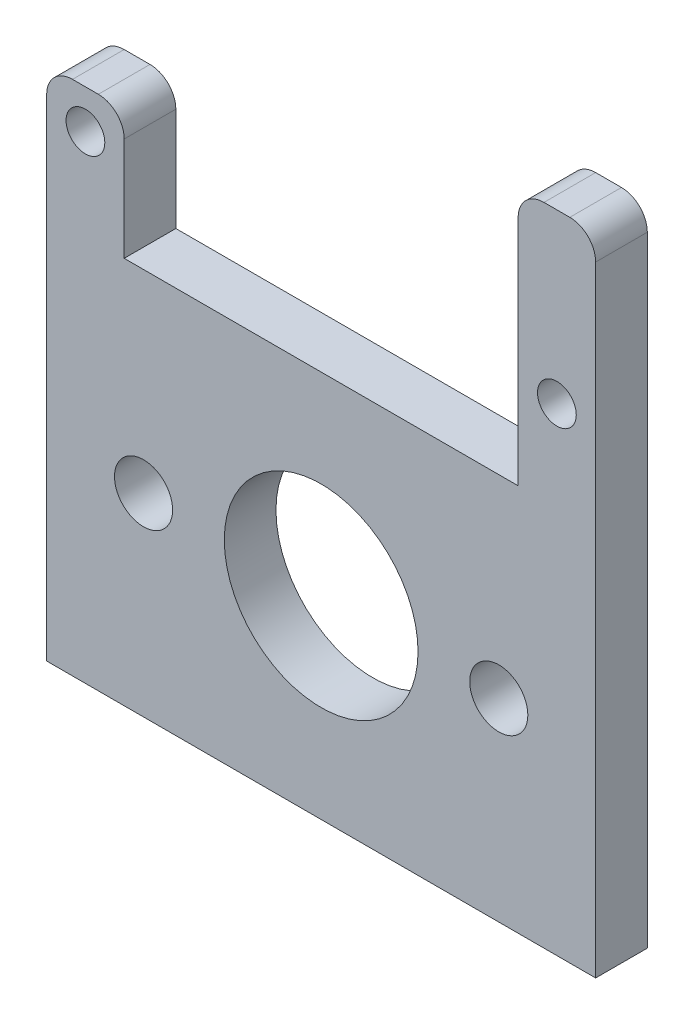
ISO-10303-21;
HEADER;
FILE_DESCRIPTION(('STEP AP214'),'2;1');
FILE_NAME('part.step','',(''),(''),'','','');
FILE_SCHEMA(('AUTOMOTIVE_DESIGN { 1 0 10303 214 1 1 1 1 }'));
ENDSEC;
DATA;
#1=APPLICATION_CONTEXT('core data for automotive mechanical design processes');
#2=APPLICATION_PROTOCOL_DEFINITION('international standard','automotive_design',2000,#1);
#3=PRODUCT_CONTEXT('',#1,'mechanical');
#4=PRODUCT('Part','Part','',(#3));
#5=PRODUCT_RELATED_PRODUCT_CATEGORY('part','',(#4));
#6=PRODUCT_DEFINITION_FORMATION('','',#4);
#7=PRODUCT_DEFINITION_CONTEXT('part definition',#1,'design');
#8=PRODUCT_DEFINITION('design','',#6,#7);
#9=PRODUCT_DEFINITION_SHAPE('','',#8);
#10=(LENGTH_UNIT() NAMED_UNIT(*) SI_UNIT(.MILLI.,.METRE.));
#11=(NAMED_UNIT(*) PLANE_ANGLE_UNIT() SI_UNIT($,.RADIAN.));
#12=(NAMED_UNIT(*) SI_UNIT($,.STERADIAN.) SOLID_ANGLE_UNIT());
#13=UNCERTAINTY_MEASURE_WITH_UNIT(LENGTH_MEASURE(1.E-05),#10,'distance_accuracy_value','');
#14=(GEOMETRIC_REPRESENTATION_CONTEXT(3) GLOBAL_UNCERTAINTY_ASSIGNED_CONTEXT((#13)) GLOBAL_UNIT_ASSIGNED_CONTEXT((#10,
#11,#12)) REPRESENTATION_CONTEXT('',''));
#15=CARTESIAN_POINT('',(0.,0.,0.));
#16=DIRECTION('',(0.,0.,1.));
#17=DIRECTION('',(1.,0.,0.));
#18=AXIS2_PLACEMENT_3D('',#15,#16,#17);
#19=CARTESIAN_POINT('',(0.,0.,4.));
#20=DIRECTION('',(0.,0.,-1.));
#21=DIRECTION('',(-1.,0.,0.));
#22=AXIS2_PLACEMENT_3D('',#19,#20,#21);
#23=PLANE('',#22);
#24=DIRECTION('',(0.,1.,0.));
#25=VECTOR('',#24,1.);
#26=CARTESIAN_POINT('',(24.4921299184247,30.6088438088065,4.));
#27=LINE('',#26,#25);
#28=CARTESIAN_POINT('',(24.4921299184247,-19.3911561911935,4.));
#29=VERTEX_POINT('',#28);
#30=CARTESIAN_POINT('',(24.4921299184247,28.6088438088065,4.));
#31=VERTEX_POINT('',#30);
#32=EDGE_CURVE('E151',#29,#31,#27,.T.);
#33=ORIENTED_EDGE('',*,*,#32,.T.);
#34=CARTESIAN_POINT('',(22.4921299184247,28.6088438088065,4.));
#35=DIRECTION('',(0.,0.,-1.));
#36=DIRECTION('',(-1.,0.,0.));
#37=AXIS2_PLACEMENT_3D('',#34,#35,#36);
#38=CIRCLE('',#37,2.);
#39=CARTESIAN_POINT('',(22.4921299184247,30.6088438088065,4.));
#40=VERTEX_POINT('',#39);
#41=EDGE_CURVE('E208',#31,#40,#38,.F.);
#42=ORIENTED_EDGE('',*,*,#41,.T.);
#43=DIRECTION('',(-1.,0.,0.));
#44=VECTOR('',#43,1.);
#45=CARTESIAN_POINT('',(18.4921299184247,30.6088438088065,4.));
#46=LINE('',#45,#44);
#47=CARTESIAN_POINT('',(20.4921299184247,30.6088438088065,4.));
#48=VERTEX_POINT('',#47);
#49=EDGE_CURVE('E153',#40,#48,#46,.T.);
#50=ORIENTED_EDGE('',*,*,#49,.T.);
#51=CARTESIAN_POINT('',(20.4921299184247,28.6088438088065,4.));
#52=DIRECTION('',(0.,0.,-1.));
#53=DIRECTION('',(-1.,0.,0.));
#54=AXIS2_PLACEMENT_3D('',#51,#52,#53);
#55=CIRCLE('',#54,2.);
#56=CARTESIAN_POINT('',(18.4921299184247,28.6088438088065,4.));
#57=VERTEX_POINT('',#56);
#58=EDGE_CURVE('E57',#48,#57,#55,.F.);
#59=ORIENTED_EDGE('',*,*,#58,.T.);
#60=DIRECTION('',(0.,-1.,0.));
#61=VECTOR('',#60,1.);
#62=CARTESIAN_POINT('',(18.4921299184247,10.6088438088065,4.));
#63=LINE('',#62,#61);
#64=CARTESIAN_POINT('',(18.4921299184247,10.6088438088065,4.));
#65=VERTEX_POINT('',#64);
#66=EDGE_CURVE('E158',#57,#65,#63,.T.);
#67=ORIENTED_EDGE('',*,*,#66,.T.);
#68=DIRECTION('',(-1.,0.,0.));
#69=VECTOR('',#68,1.);
#70=CARTESIAN_POINT('',(-12.0078700815753,10.6088438088065,4.));
#71=LINE('',#70,#69);
#72=CARTESIAN_POINT('',(-12.0078700815753,10.6088438088065,4.));
#73=VERTEX_POINT('',#72);
#74=EDGE_CURVE('E160',#65,#73,#71,.T.);
#75=ORIENTED_EDGE('',*,*,#74,.T.);
#76=DIRECTION('',(0.,1.,0.));
#77=VECTOR('',#76,1.);
#78=CARTESIAN_POINT('',(-12.0078700815753,20.6088438088065,4.));
#79=LINE('',#78,#77);
#80=CARTESIAN_POINT('',(-12.0078700815753,18.6088438088065,4.));
#81=VERTEX_POINT('',#80);
#82=EDGE_CURVE('E162',#73,#81,#79,.T.);
#83=ORIENTED_EDGE('',*,*,#82,.T.);
#84=CARTESIAN_POINT('',(-14.0078700815753,18.6088438088065,4.));
#85=DIRECTION('',(0.,0.,-1.));
#86=DIRECTION('',(-1.,0.,0.));
#87=AXIS2_PLACEMENT_3D('',#84,#85,#86);
#88=CIRCLE('',#87,2.);
#89=CARTESIAN_POINT('',(-14.0078700815753,20.6088438088065,4.));
#90=VERTEX_POINT('',#89);
#91=EDGE_CURVE('E205',#81,#90,#88,.F.);
#92=ORIENTED_EDGE('',*,*,#91,.T.);
#93=DIRECTION('',(-1.,0.,0.));
#94=VECTOR('',#93,1.);
#95=CARTESIAN_POINT('',(-18.0078700815753,20.6088438088065,4.));
#96=LINE('',#95,#94);
#97=CARTESIAN_POINT('',(-16.0078700815753,20.6088438088065,4.));
#98=VERTEX_POINT('',#97);
#99=EDGE_CURVE('E136',#90,#98,#96,.T.);
#100=ORIENTED_EDGE('',*,*,#99,.T.);
#101=CARTESIAN_POINT('',(-16.0078700815753,18.6088438088065,4.));
#102=DIRECTION('',(0.,0.,-1.));
#103=DIRECTION('',(-1.,0.,0.));
#104=AXIS2_PLACEMENT_3D('',#101,#102,#103);
#105=CIRCLE('',#104,2.);
#106=CARTESIAN_POINT('',(-18.0078700815753,18.6088438088065,4.));
#107=VERTEX_POINT('',#106);
#108=EDGE_CURVE('E133',#98,#107,#105,.F.);
#109=ORIENTED_EDGE('',*,*,#108,.T.);
#110=DIRECTION('',(0.,-1.,0.));
#111=VECTOR('',#110,1.);
#112=CARTESIAN_POINT('',(-18.0078700815753,20.6088438088065,4.));
#113=LINE('',#112,#111);
#114=CARTESIAN_POINT('',(-18.0078700815753,-19.3911561911935,4.));
#115=VERTEX_POINT('',#114);
#116=EDGE_CURVE('E124',#107,#115,#113,.T.);
#117=ORIENTED_EDGE('',*,*,#116,.T.);
#118=DIRECTION('',(1.,0.,0.));
#119=VECTOR('',#118,1.);
#120=CARTESIAN_POINT('',(24.4921299184247,-19.3911561911935,4.));
#121=LINE('',#120,#119);
#122=EDGE_CURVE('E129',#115,#29,#121,.T.);
#123=ORIENTED_EDGE('',*,*,#122,.T.);
#124=EDGE_LOOP('',(#33,#42,#50,#59,#67,#75,#83,#92,#100,#109,#117,#123));
#125=FACE_BOUND('',#124,.T.);
#126=CARTESIAN_POINT('',(-15.0078700815753,17.6088438088065,4.));
#127=DIRECTION('',(0.,0.,1.));
#128=DIRECTION('',(1.,0.,0.));
#129=AXIS2_PLACEMENT_3D('',#126,#127,#128);
#130=CIRCLE('',#129,1.5);
#131=CARTESIAN_POINT('',(-13.5078700815753,17.6088438088065,4.));
#132=VERTEX_POINT('',#131);
#133=EDGE_CURVE('E168',#132,#132,#130,.T.);
#134=ORIENTED_EDGE('',*,*,#133,.F.);
#135=EDGE_LOOP('',(#134));
#136=FACE_BOUND('',#135,.T.);
#137=CARTESIAN_POINT('',(21.4921299184247,17.6088438088065,4.));
#138=DIRECTION('',(0.,0.,1.));
#139=DIRECTION('',(1.,0.,0.));
#140=AXIS2_PLACEMENT_3D('',#137,#138,#139);
#141=CIRCLE('',#140,1.5);
#142=CARTESIAN_POINT('',(22.9921299184247,17.6088438088065,4.));
#143=VERTEX_POINT('',#142);
#144=EDGE_CURVE('E235',#143,#143,#141,.T.);
#145=ORIENTED_EDGE('',*,*,#144,.F.);
#146=EDGE_LOOP('',(#145));
#147=FACE_BOUND('',#146,.T.);
#148=CARTESIAN_POINT('',(-10.5078700815753,-4.39115619119349,4.));
#149=DIRECTION('',(0.,0.,1.));
#150=DIRECTION('',(1.,0.,0.));
#151=AXIS2_PLACEMENT_3D('',#148,#149,#150);
#152=CIRCLE('',#151,2.25);
#153=CARTESIAN_POINT('',(-8.25787008157528,-4.39115619119349,4.));
#154=VERTEX_POINT('',#153);
#155=EDGE_CURVE('E241',#154,#154,#152,.T.);
#156=ORIENTED_EDGE('',*,*,#155,.F.);
#157=EDGE_LOOP('',(#156));
#158=FACE_BOUND('',#157,.T.);
#159=CARTESIAN_POINT('',(16.9921299184247,-4.39115619119348,4.));
#160=DIRECTION('',(0.,0.,1.));
#161=DIRECTION('',(1.,0.,0.));
#162=AXIS2_PLACEMENT_3D('',#159,#160,#161);
#163=CIRCLE('',#162,2.25);
#164=CARTESIAN_POINT('',(19.2421299184247,-4.39115619119348,4.));
#165=VERTEX_POINT('',#164);
#166=EDGE_CURVE('E247',#165,#165,#163,.T.);
#167=ORIENTED_EDGE('',*,*,#166,.F.);
#168=EDGE_LOOP('',(#167));
#169=FACE_BOUND('',#168,.T.);
#170=CARTESIAN_POINT('',(3.24212991842472,-4.39115619119348,4.));
#171=DIRECTION('',(0.,0.,1.));
#172=DIRECTION('',(1.,0.,0.));
#173=AXIS2_PLACEMENT_3D('',#170,#171,#172);
#174=CIRCLE('',#173,7.5);
#175=CARTESIAN_POINT('',(10.7421299184247,-4.39115619119348,4.));
#176=VERTEX_POINT('',#175);
#177=EDGE_CURVE('E253',#176,#176,#174,.T.);
#178=ORIENTED_EDGE('',*,*,#177,.F.);
#179=EDGE_LOOP('',(#178));
#180=FACE_BOUND('',#179,.T.);
#181=ADVANCED_FACE('F35',(#125,#136,#147,#158,#169,#180),#23,.F.);
#182=CARTESIAN_POINT('',(0.,0.,0.));
#183=DIRECTION('',(0.,0.,-1.));
#184=DIRECTION('',(-1.,0.,0.));
#185=AXIS2_PLACEMENT_3D('',#182,#183,#184);
#186=PLANE('',#185);
#187=CARTESIAN_POINT('',(16.9921299184247,-4.39115619119348,0.));
#188=DIRECTION('',(0.,0.,1.));
#189=DIRECTION('',(1.,0.,0.));
#190=AXIS2_PLACEMENT_3D('',#187,#188,#189);
#191=CIRCLE('',#190,2.25);
#192=CARTESIAN_POINT('',(19.2421299184247,-4.39115619119348,0.));
#193=VERTEX_POINT('',#192);
#194=EDGE_CURVE('E250',#193,#193,#191,.T.);
#195=ORIENTED_EDGE('',*,*,#194,.T.);
#196=EDGE_LOOP('',(#195));
#197=FACE_BOUND('',#196,.T.);
#198=CARTESIAN_POINT('',(21.4921299184247,17.6088438088065,0.));
#199=DIRECTION('',(0.,0.,1.));
#200=DIRECTION('',(1.,0.,0.));
#201=AXIS2_PLACEMENT_3D('',#198,#199,#200);
#202=CIRCLE('',#201,1.5);
#203=CARTESIAN_POINT('',(22.9921299184247,17.6088438088065,0.));
#204=VERTEX_POINT('',#203);
#205=EDGE_CURVE('E238',#204,#204,#202,.T.);
#206=ORIENTED_EDGE('',*,*,#205,.T.);
#207=EDGE_LOOP('',(#206));
#208=FACE_BOUND('',#207,.T.);
#209=DIRECTION('',(-1.,0.,0.));
#210=VECTOR('',#209,1.);
#211=CARTESIAN_POINT('',(18.4921299184247,30.6088438088065,0.));
#212=LINE('',#211,#210);
#213=CARTESIAN_POINT('',(22.4921299184247,30.6088438088065,0.));
#214=VERTEX_POINT('',#213);
#215=CARTESIAN_POINT('',(20.4921299184247,30.6088438088065,0.));
#216=VERTEX_POINT('',#215);
#217=EDGE_CURVE('E175',#214,#216,#212,.T.);
#218=ORIENTED_EDGE('',*,*,#217,.F.);
#219=CARTESIAN_POINT('',(22.4921299184247,28.6088438088065,0.));
#220=DIRECTION('',(0.,0.,-1.));
#221=DIRECTION('',(-1.,0.,0.));
#222=AXIS2_PLACEMENT_3D('',#219,#220,#221);
#223=CIRCLE('',#222,2.);
#224=CARTESIAN_POINT('',(24.4921299184247,28.6088438088065,0.));
#225=VERTEX_POINT('',#224);
#226=EDGE_CURVE('E200',#214,#225,#223,.T.);
#227=ORIENTED_EDGE('',*,*,#226,.T.);
#228=DIRECTION('',(0.,1.,0.));
#229=VECTOR('',#228,1.);
#230=CARTESIAN_POINT('',(24.4921299184247,30.6088438088065,0.));
#231=LINE('',#230,#229);
#232=CARTESIAN_POINT('',(24.4921299184247,-19.3911561911935,0.));
#233=VERTEX_POINT('',#232);
#234=EDGE_CURVE('E172',#233,#225,#231,.T.);
#235=ORIENTED_EDGE('',*,*,#234,.F.);
#236=DIRECTION('',(1.,0.,0.));
#237=VECTOR('',#236,1.);
#238=CARTESIAN_POINT('',(24.4921299184247,-19.3911561911935,0.));
#239=LINE('',#238,#237);
#240=CARTESIAN_POINT('',(-18.0078700815753,-19.3911561911935,0.));
#241=VERTEX_POINT('',#240);
#242=EDGE_CURVE('E170',#241,#233,#239,.T.);
#243=ORIENTED_EDGE('',*,*,#242,.F.);
#244=DIRECTION('',(0.,-1.,0.));
#245=VECTOR('',#244,1.);
#246=CARTESIAN_POINT('',(-18.0078700815753,-19.3911561911935,0.));
#247=LINE('',#246,#245);
#248=CARTESIAN_POINT('',(-18.0078700815753,18.6088438088065,0.));
#249=VERTEX_POINT('',#248);
#250=EDGE_CURVE('E142',#249,#241,#247,.T.);
#251=ORIENTED_EDGE('',*,*,#250,.F.);
#252=CARTESIAN_POINT('',(-16.0078700815753,18.6088438088065,0.));
#253=DIRECTION('',(0.,0.,-1.));
#254=DIRECTION('',(-1.,0.,0.));
#255=AXIS2_PLACEMENT_3D('',#252,#253,#254);
#256=CIRCLE('',#255,2.);
#257=CARTESIAN_POINT('',(-16.0078700815753,20.6088438088065,0.));
#258=VERTEX_POINT('',#257);
#259=EDGE_CURVE('E194',#249,#258,#256,.T.);
#260=ORIENTED_EDGE('',*,*,#259,.T.);
#261=DIRECTION('',(-1.,0.,0.));
#262=VECTOR('',#261,1.);
#263=CARTESIAN_POINT('',(-18.0078700815753,20.6088438088065,0.));
#264=LINE('',#263,#262);
#265=CARTESIAN_POINT('',(-14.0078700815753,20.6088438088065,0.));
#266=VERTEX_POINT('',#265);
#267=EDGE_CURVE('E165',#266,#258,#264,.T.);
#268=ORIENTED_EDGE('',*,*,#267,.F.);
#269=CARTESIAN_POINT('',(-14.0078700815753,18.6088438088065,0.));
#270=DIRECTION('',(0.,0.,-1.));
#271=DIRECTION('',(-1.,0.,0.));
#272=AXIS2_PLACEMENT_3D('',#269,#270,#271);
#273=CIRCLE('',#272,2.);
#274=CARTESIAN_POINT('',(-12.0078700815753,18.6088438088065,0.));
#275=VERTEX_POINT('',#274);
#276=EDGE_CURVE('E196',#266,#275,#273,.T.);
#277=ORIENTED_EDGE('',*,*,#276,.T.);
#278=DIRECTION('',(0.,1.,0.));
#279=VECTOR('',#278,1.);
#280=CARTESIAN_POINT('',(-12.0078700815753,20.6088438088065,0.));
#281=LINE('',#280,#279);
#282=CARTESIAN_POINT('',(-12.0078700815753,10.6088438088065,0.));
#283=VERTEX_POINT('',#282);
#284=EDGE_CURVE('E182',#283,#275,#281,.T.);
#285=ORIENTED_EDGE('',*,*,#284,.F.);
#286=DIRECTION('',(-1.,0.,0.));
#287=VECTOR('',#286,1.);
#288=CARTESIAN_POINT('',(-12.0078700815753,10.6088438088065,0.));
#289=LINE('',#288,#287);
#290=CARTESIAN_POINT('',(18.4921299184247,10.6088438088065,0.));
#291=VERTEX_POINT('',#290);
#292=EDGE_CURVE('E180',#291,#283,#289,.T.);
#293=ORIENTED_EDGE('',*,*,#292,.F.);
#294=DIRECTION('',(0.,-1.,0.));
#295=VECTOR('',#294,1.);
#296=CARTESIAN_POINT('',(18.4921299184247,10.6088438088065,0.));
#297=LINE('',#296,#295);
#298=CARTESIAN_POINT('',(18.4921299184247,28.6088438088065,0.));
#299=VERTEX_POINT('',#298);
#300=EDGE_CURVE('E178',#299,#291,#297,.T.);
#301=ORIENTED_EDGE('',*,*,#300,.F.);
#302=CARTESIAN_POINT('',(20.4921299184247,28.6088438088065,0.));
#303=DIRECTION('',(0.,0.,-1.));
#304=DIRECTION('',(-1.,0.,0.));
#305=AXIS2_PLACEMENT_3D('',#302,#303,#304);
#306=CIRCLE('',#305,2.);
#307=EDGE_CURVE('E198',#299,#216,#306,.T.);
#308=ORIENTED_EDGE('',*,*,#307,.T.);
#309=EDGE_LOOP('',(#218,#227,#235,#243,#251,#260,#268,#277,#285,#293,#301,#308));
#310=FACE_BOUND('',#309,.T.);
#311=CARTESIAN_POINT('',(-15.0078700815753,17.6088438088065,0.));
#312=DIRECTION('',(0.,0.,1.));
#313=DIRECTION('',(1.,0.,0.));
#314=AXIS2_PLACEMENT_3D('',#311,#312,#313);
#315=CIRCLE('',#314,1.5);
#316=CARTESIAN_POINT('',(-13.5078700815753,17.6088438088065,0.));
#317=VERTEX_POINT('',#316);
#318=EDGE_CURVE('E232',#317,#317,#315,.T.);
#319=ORIENTED_EDGE('',*,*,#318,.T.);
#320=EDGE_LOOP('',(#319));
#321=FACE_BOUND('',#320,.T.);
#322=CARTESIAN_POINT('',(-10.5078700815753,-4.39115619119349,0.));
#323=DIRECTION('',(0.,0.,1.));
#324=DIRECTION('',(1.,0.,0.));
#325=AXIS2_PLACEMENT_3D('',#322,#323,#324);
#326=CIRCLE('',#325,2.25);
#327=CARTESIAN_POINT('',(-8.25787008157528,-4.39115619119349,0.));
#328=VERTEX_POINT('',#327);
#329=EDGE_CURVE('E244',#328,#328,#326,.T.);
#330=ORIENTED_EDGE('',*,*,#329,.T.);
#331=EDGE_LOOP('',(#330));
#332=FACE_BOUND('',#331,.T.);
#333=CARTESIAN_POINT('',(3.24212991842472,-4.39115619119348,0.));
#334=DIRECTION('',(0.,0.,1.));
#335=DIRECTION('',(1.,0.,0.));
#336=AXIS2_PLACEMENT_3D('',#333,#334,#335);
#337=CIRCLE('',#336,7.5);
#338=CARTESIAN_POINT('',(10.7421299184247,-4.39115619119348,0.));
#339=VERTEX_POINT('',#338);
#340=EDGE_CURVE('E256',#339,#339,#337,.T.);
#341=ORIENTED_EDGE('',*,*,#340,.T.);
#342=EDGE_LOOP('',(#341));
#343=FACE_BOUND('',#342,.T.);
#344=ADVANCED_FACE('F227',(#197,#208,#310,#321,#332,#343),#186,.T.);
#345=CARTESIAN_POINT('',(-18.0078700815753,20.6088438088065,4.));
#346=DIRECTION('',(0.,-1.,0.));
#347=DIRECTION('',(0.,0.,-1.));
#348=AXIS2_PLACEMENT_3D('',#345,#346,#347);
#349=PLANE('',#348);
#350=ORIENTED_EDGE('',*,*,#99,.F.);
#351=DIRECTION('',(0.,0.,-1.));
#352=VECTOR('',#351,1.);
#353=CARTESIAN_POINT('',(-14.0078700815753,20.6088438088065,4.));
#354=LINE('',#353,#352);
#355=EDGE_CURVE('E215',#90,#266,#354,.T.);
#356=ORIENTED_EDGE('',*,*,#355,.T.);
#357=ORIENTED_EDGE('',*,*,#267,.T.);
#358=DIRECTION('',(0.,0.,-1.));
#359=VECTOR('',#358,1.);
#360=CARTESIAN_POINT('',(-16.0078700815753,20.6088438088065,4.));
#361=LINE('',#360,#359);
#362=EDGE_CURVE('E213',#258,#98,#361,.F.);
#363=ORIENTED_EDGE('',*,*,#362,.T.);
#364=EDGE_LOOP('',(#350,#356,#357,#363));
#365=FACE_BOUND('',#364,.T.);
#366=ADVANCED_FACE('F221',(#365),#349,.F.);
#367=CARTESIAN_POINT('',(-18.0078700815753,-19.3911561911935,4.));
#368=DIRECTION('',(1.,0.,0.));
#369=DIRECTION('',(0.,0.,-1.));
#370=AXIS2_PLACEMENT_3D('',#367,#368,#369);
#371=PLANE('',#370);
#372=ORIENTED_EDGE('',*,*,#116,.F.);
#373=DIRECTION('',(0.,0.,-1.));
#374=VECTOR('',#373,1.);
#375=CARTESIAN_POINT('',(-18.0078700815753,18.6088438088065,4.));
#376=LINE('',#375,#374);
#377=EDGE_CURVE('E11',#107,#249,#376,.T.);
#378=ORIENTED_EDGE('',*,*,#377,.T.);
#379=ORIENTED_EDGE('',*,*,#250,.T.);
#380=DIRECTION('',(0.,0.,-1.));
#381=VECTOR('',#380,1.);
#382=CARTESIAN_POINT('',(-18.0078700815753,-19.3911561911935,4.));
#383=LINE('',#382,#381);
#384=EDGE_CURVE('E139',#115,#241,#383,.T.);
#385=ORIENTED_EDGE('',*,*,#384,.F.);
#386=EDGE_LOOP('',(#372,#378,#379,#385));
#387=FACE_BOUND('',#386,.T.);
#388=ADVANCED_FACE('F140',(#387),#371,.F.);
#389=CARTESIAN_POINT('',(24.4921299184247,-19.3911561911935,4.));
#390=DIRECTION('',(0.,1.,0.));
#391=DIRECTION('',(-1.,0.,0.));
#392=AXIS2_PLACEMENT_3D('',#389,#390,#391);
#393=PLANE('',#392);
#394=ORIENTED_EDGE('',*,*,#242,.T.);
#395=DIRECTION('',(0.,0.,-1.));
#396=VECTOR('',#395,1.);
#397=CARTESIAN_POINT('',(24.4921299184247,-19.3911561911935,4.));
#398=LINE('',#397,#396);
#399=EDGE_CURVE('E146',#29,#233,#398,.T.);
#400=ORIENTED_EDGE('',*,*,#399,.F.);
#401=ORIENTED_EDGE('',*,*,#122,.F.);
#402=ORIENTED_EDGE('',*,*,#384,.T.);
#403=EDGE_LOOP('',(#394,#400,#401,#402));
#404=FACE_BOUND('',#403,.T.);
#405=ADVANCED_FACE('F148',(#404),#393,.F.);
#406=CARTESIAN_POINT('',(24.4921299184247,30.6088438088065,4.));
#407=DIRECTION('',(-1.,0.,0.));
#408=DIRECTION('',(0.,-1.,0.));
#409=AXIS2_PLACEMENT_3D('',#406,#407,#408);
#410=PLANE('',#409);
#411=ORIENTED_EDGE('',*,*,#234,.T.);
#412=DIRECTION('',(0.,0.,-1.));
#413=VECTOR('',#412,1.);
#414=CARTESIAN_POINT('',(24.4921299184247,28.6088438088065,4.));
#415=LINE('',#414,#413);
#416=EDGE_CURVE('E202',#225,#31,#415,.F.);
#417=ORIENTED_EDGE('',*,*,#416,.T.);
#418=ORIENTED_EDGE('',*,*,#32,.F.);
#419=ORIENTED_EDGE('',*,*,#399,.T.);
#420=EDGE_LOOP('',(#411,#417,#418,#419));
#421=FACE_BOUND('',#420,.T.);
#422=ADVANCED_FACE('F290',(#421),#410,.F.);
#423=CARTESIAN_POINT('',(18.4921299184247,30.6088438088065,4.));
#424=DIRECTION('',(0.,-1.,0.));
#425=DIRECTION('',(0.,0.,-1.));
#426=AXIS2_PLACEMENT_3D('',#423,#424,#425);
#427=PLANE('',#426);
#428=ORIENTED_EDGE('',*,*,#49,.F.);
#429=DIRECTION('',(0.,0.,-1.));
#430=VECTOR('',#429,1.);
#431=CARTESIAN_POINT('',(22.4921299184247,30.6088438088065,4.));
#432=LINE('',#431,#430);
#433=EDGE_CURVE('E191',#40,#214,#432,.T.);
#434=ORIENTED_EDGE('',*,*,#433,.T.);
#435=ORIENTED_EDGE('',*,*,#217,.T.);
#436=DIRECTION('',(0.,0.,-1.));
#437=VECTOR('',#436,1.);
#438=CARTESIAN_POINT('',(20.4921299184247,30.6088438088065,4.));
#439=LINE('',#438,#437);
#440=EDGE_CURVE('E145',#216,#48,#439,.F.);
#441=ORIENTED_EDGE('',*,*,#440,.T.);
#442=EDGE_LOOP('',(#428,#434,#435,#441));
#443=FACE_BOUND('',#442,.T.);
#444=ADVANCED_FACE('F286',(#443),#427,.F.);
#445=CARTESIAN_POINT('',(18.4921299184247,10.6088438088065,4.));
#446=DIRECTION('',(1.,0.,0.));
#447=DIRECTION('',(0.,0.,-1.));
#448=AXIS2_PLACEMENT_3D('',#445,#446,#447);
#449=PLANE('',#448);
#450=ORIENTED_EDGE('',*,*,#66,.F.);
#451=DIRECTION('',(0.,0.,-1.));
#452=VECTOR('',#451,1.);
#453=CARTESIAN_POINT('',(18.4921299184247,28.6088438088065,4.));
#454=LINE('',#453,#452);
#455=EDGE_CURVE('E210',#57,#299,#454,.T.);
#456=ORIENTED_EDGE('',*,*,#455,.T.);
#457=ORIENTED_EDGE('',*,*,#300,.T.);
#458=DIRECTION('',(0.,0.,-1.));
#459=VECTOR('',#458,1.);
#460=CARTESIAN_POINT('',(18.4921299184247,10.6088438088065,4.));
#461=LINE('',#460,#459);
#462=EDGE_CURVE('E186',#65,#291,#461,.T.);
#463=ORIENTED_EDGE('',*,*,#462,.F.);
#464=EDGE_LOOP('',(#450,#456,#457,#463));
#465=FACE_BOUND('',#464,.T.);
#466=ADVANCED_FACE('F282',(#465),#449,.F.);
#467=CARTESIAN_POINT('',(-12.0078700815753,10.6088438088065,4.));
#468=DIRECTION('',(0.,-1.,0.));
#469=DIRECTION('',(1.,0.,0.));
#470=AXIS2_PLACEMENT_3D('',#467,#468,#469);
#471=PLANE('',#470);
#472=ORIENTED_EDGE('',*,*,#292,.T.);
#473=DIRECTION('',(0.,0.,-1.));
#474=VECTOR('',#473,1.);
#475=CARTESIAN_POINT('',(-12.0078700815753,10.6088438088065,4.));
#476=LINE('',#475,#474);
#477=EDGE_CURVE('E164',#73,#283,#476,.T.);
#478=ORIENTED_EDGE('',*,*,#477,.F.);
#479=ORIENTED_EDGE('',*,*,#74,.F.);
#480=ORIENTED_EDGE('',*,*,#462,.T.);
#481=EDGE_LOOP('',(#472,#478,#479,#480));
#482=FACE_BOUND('',#481,.T.);
#483=ADVANCED_FACE('F279',(#482),#471,.F.);
#484=CARTESIAN_POINT('',(-12.0078700815753,20.6088438088065,4.));
#485=DIRECTION('',(-1.,0.,0.));
#486=DIRECTION('',(0.,0.,1.));
#487=AXIS2_PLACEMENT_3D('',#484,#485,#486);
#488=PLANE('',#487);
#489=ORIENTED_EDGE('',*,*,#284,.T.);
#490=DIRECTION('',(0.,0.,-1.));
#491=VECTOR('',#490,1.);
#492=CARTESIAN_POINT('',(-12.0078700815753,18.6088438088065,4.));
#493=LINE('',#492,#491);
#494=EDGE_CURVE('E43',#275,#81,#493,.F.);
#495=ORIENTED_EDGE('',*,*,#494,.T.);
#496=ORIENTED_EDGE('',*,*,#82,.F.);
#497=ORIENTED_EDGE('',*,*,#477,.T.);
#498=EDGE_LOOP('',(#489,#495,#496,#497));
#499=FACE_BOUND('',#498,.T.);
#500=ADVANCED_FACE('F276',(#499),#488,.F.);
#501=CARTESIAN_POINT('',(-15.0078700815753,17.6088438088065,4.));
#502=DIRECTION('',(0.,0.,-1.));
#503=DIRECTION('',(-1.,0.,0.));
#504=AXIS2_PLACEMENT_3D('',#501,#502,#503);
#505=CYLINDRICAL_SURFACE('',#504,1.5);
#506=ORIENTED_EDGE('',*,*,#133,.T.);
#507=EDGE_LOOP('',(#506));
#508=FACE_BOUND('',#507,.T.);
#509=ORIENTED_EDGE('',*,*,#318,.F.);
#510=EDGE_LOOP('',(#509));
#511=FACE_BOUND('',#510,.T.);
#512=ADVANCED_FACE('F273',(#508,#511),#505,.F.);
#513=CARTESIAN_POINT('',(21.4921299184247,17.6088438088065,4.));
#514=DIRECTION('',(0.,0.,-1.));
#515=DIRECTION('',(-1.,0.,0.));
#516=AXIS2_PLACEMENT_3D('',#513,#514,#515);
#517=CYLINDRICAL_SURFACE('',#516,1.5);
#518=ORIENTED_EDGE('',*,*,#144,.T.);
#519=EDGE_LOOP('',(#518));
#520=FACE_BOUND('',#519,.T.);
#521=ORIENTED_EDGE('',*,*,#205,.F.);
#522=EDGE_LOOP('',(#521));
#523=FACE_BOUND('',#522,.T.);
#524=ADVANCED_FACE('F410',(#520,#523),#517,.F.);
#525=CARTESIAN_POINT('',(-10.5078700815753,-4.39115619119349,4.));
#526=DIRECTION('',(0.,0.,-1.));
#527=DIRECTION('',(-1.,0.,0.));
#528=AXIS2_PLACEMENT_3D('',#525,#526,#527);
#529=CYLINDRICAL_SURFACE('',#528,2.25);
#530=ORIENTED_EDGE('',*,*,#155,.T.);
#531=EDGE_LOOP('',(#530));
#532=FACE_BOUND('',#531,.T.);
#533=ORIENTED_EDGE('',*,*,#329,.F.);
#534=EDGE_LOOP('',(#533));
#535=FACE_BOUND('',#534,.T.);
#536=ADVANCED_FACE('F400',(#532,#535),#529,.F.);
#537=CARTESIAN_POINT('',(16.9921299184247,-4.39115619119348,4.));
#538=DIRECTION('',(0.,0.,-1.));
#539=DIRECTION('',(-1.,0.,0.));
#540=AXIS2_PLACEMENT_3D('',#537,#538,#539);
#541=CYLINDRICAL_SURFACE('',#540,2.25);
#542=ORIENTED_EDGE('',*,*,#166,.T.);
#543=EDGE_LOOP('',(#542));
#544=FACE_BOUND('',#543,.T.);
#545=ORIENTED_EDGE('',*,*,#194,.F.);
#546=EDGE_LOOP('',(#545));
#547=FACE_BOUND('',#546,.T.);
#548=ADVANCED_FACE('F391',(#544,#547),#541,.F.);
#549=CARTESIAN_POINT('',(3.24212991842472,-4.39115619119348,4.));
#550=DIRECTION('',(0.,0.,-1.));
#551=DIRECTION('',(-1.,0.,0.));
#552=AXIS2_PLACEMENT_3D('',#549,#550,#551);
#553=CYLINDRICAL_SURFACE('',#552,7.5);
#554=ORIENTED_EDGE('',*,*,#177,.T.);
#555=EDGE_LOOP('',(#554));
#556=FACE_BOUND('',#555,.T.);
#557=ORIENTED_EDGE('',*,*,#340,.F.);
#558=EDGE_LOOP('',(#557));
#559=FACE_BOUND('',#558,.T.);
#560=ADVANCED_FACE('F262',(#556,#559),#553,.F.);
#561=CARTESIAN_POINT('',(22.4921299184247,28.6088438088065,4.));
#562=DIRECTION('',(0.,0.,-1.));
#563=DIRECTION('',(-1.,0.,0.));
#564=AXIS2_PLACEMENT_3D('',#561,#562,#563);
#565=CYLINDRICAL_SURFACE('',#564,2.);
#566=ORIENTED_EDGE('',*,*,#41,.F.);
#567=ORIENTED_EDGE('',*,*,#416,.F.);
#568=ORIENTED_EDGE('',*,*,#226,.F.);
#569=ORIENTED_EDGE('',*,*,#433,.F.);
#570=EDGE_LOOP('',(#566,#567,#568,#569));
#571=FACE_BOUND('',#570,.T.);
#572=ADVANCED_FACE('F301',(#571),#565,.T.);
#573=CARTESIAN_POINT('',(20.4921299184247,28.6088438088065,4.));
#574=DIRECTION('',(0.,0.,-1.));
#575=DIRECTION('',(-1.,0.,0.));
#576=AXIS2_PLACEMENT_3D('',#573,#574,#575);
#577=CYLINDRICAL_SURFACE('',#576,2.);
#578=ORIENTED_EDGE('',*,*,#58,.F.);
#579=ORIENTED_EDGE('',*,*,#440,.F.);
#580=ORIENTED_EDGE('',*,*,#307,.F.);
#581=ORIENTED_EDGE('',*,*,#455,.F.);
#582=EDGE_LOOP('',(#578,#579,#580,#581));
#583=FACE_BOUND('',#582,.T.);
#584=ADVANCED_FACE('F304',(#583),#577,.T.);
#585=CARTESIAN_POINT('',(-14.0078700815753,18.6088438088065,4.));
#586=DIRECTION('',(0.,0.,-1.));
#587=DIRECTION('',(-1.,0.,0.));
#588=AXIS2_PLACEMENT_3D('',#585,#586,#587);
#589=CYLINDRICAL_SURFACE('',#588,2.);
#590=ORIENTED_EDGE('',*,*,#91,.F.);
#591=ORIENTED_EDGE('',*,*,#494,.F.);
#592=ORIENTED_EDGE('',*,*,#276,.F.);
#593=ORIENTED_EDGE('',*,*,#355,.F.);
#594=EDGE_LOOP('',(#590,#591,#592,#593));
#595=FACE_BOUND('',#594,.T.);
#596=ADVANCED_FACE('F307',(#595),#589,.T.);
#597=CARTESIAN_POINT('',(-16.0078700815753,18.6088438088065,4.));
#598=DIRECTION('',(0.,0.,-1.));
#599=DIRECTION('',(-1.,0.,0.));
#600=AXIS2_PLACEMENT_3D('',#597,#598,#599);
#601=CYLINDRICAL_SURFACE('',#600,2.);
#602=ORIENTED_EDGE('',*,*,#108,.F.);
#603=ORIENTED_EDGE('',*,*,#362,.F.);
#604=ORIENTED_EDGE('',*,*,#259,.F.);
#605=ORIENTED_EDGE('',*,*,#377,.F.);
#606=EDGE_LOOP('',(#602,#603,#604,#605));
#607=FACE_BOUND('',#606,.T.);
#608=ADVANCED_FACE('F37',(#607),#601,.T.);
#609=CLOSED_SHELL('',(#181,#344,#366,#388,#405,#422,#444,#466,#483,#500,#512,#524,#536,#548,
#560,#572,#584,#596,#608));
#610=MANIFOLD_SOLID_BREP('B2',#609);
#611=ADVANCED_BREP_SHAPE_REPRESENTATION('',(#18,#610),#14);
#612=SHAPE_DEFINITION_REPRESENTATION(#9,#611);
ENDSEC;
END-ISO-10303-21;
